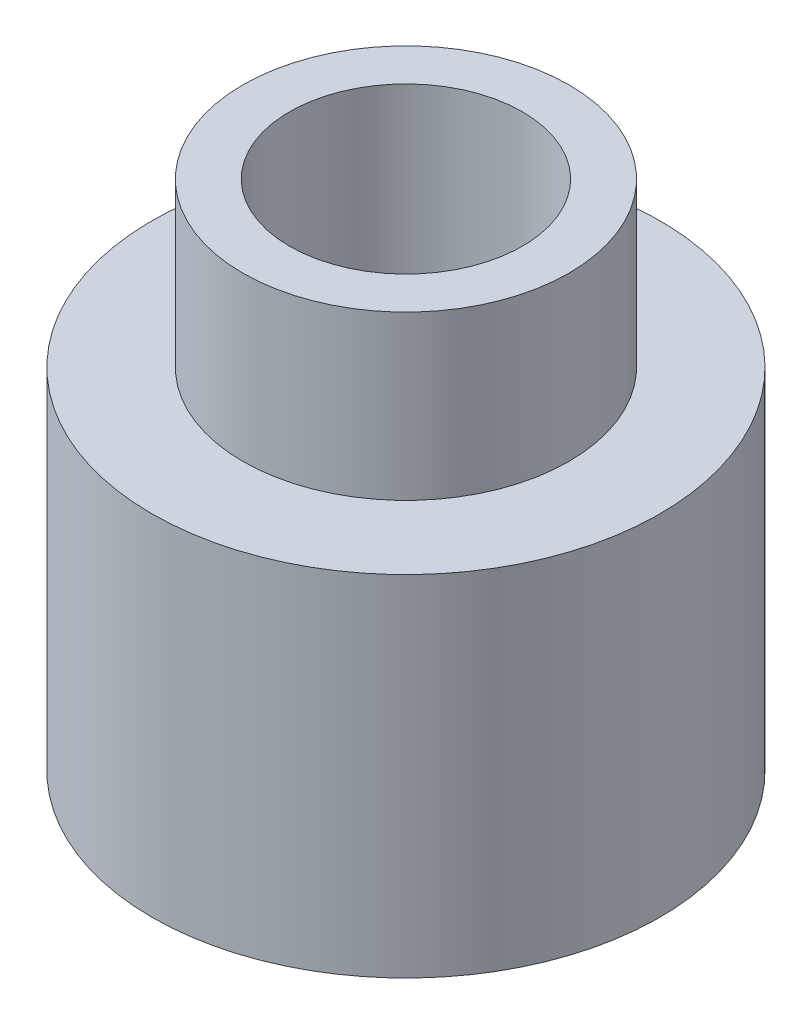
ISO-10303-21;
HEADER;
FILE_DESCRIPTION(('STEP AP214'),'2;1');
FILE_NAME('part.step','',(''),(''),'','','');
FILE_SCHEMA(('AUTOMOTIVE_DESIGN { 1 0 10303 214 1 1 1 1 }'));
ENDSEC;
DATA;
#1=APPLICATION_CONTEXT('core data for automotive mechanical design processes');
#2=APPLICATION_PROTOCOL_DEFINITION('international standard','automotive_design',2000,#1);
#3=PRODUCT_CONTEXT('',#1,'mechanical');
#4=PRODUCT('Part','Part','',(#3));
#5=PRODUCT_RELATED_PRODUCT_CATEGORY('part','',(#4));
#6=PRODUCT_DEFINITION_FORMATION('','',#4);
#7=PRODUCT_DEFINITION_CONTEXT('part definition',#1,'design');
#8=PRODUCT_DEFINITION('design','',#6,#7);
#9=PRODUCT_DEFINITION_SHAPE('','',#8);
#10=(LENGTH_UNIT() NAMED_UNIT(*) SI_UNIT(.MILLI.,.METRE.));
#11=(NAMED_UNIT(*) PLANE_ANGLE_UNIT() SI_UNIT($,.RADIAN.));
#12=(NAMED_UNIT(*) SI_UNIT($,.STERADIAN.) SOLID_ANGLE_UNIT());
#13=UNCERTAINTY_MEASURE_WITH_UNIT(LENGTH_MEASURE(1.E-05),#10,'distance_accuracy_value','');
#14=(GEOMETRIC_REPRESENTATION_CONTEXT(3) GLOBAL_UNCERTAINTY_ASSIGNED_CONTEXT((#13)) GLOBAL_UNIT_ASSIGNED_CONTEXT((#10,
#11,#12)) REPRESENTATION_CONTEXT('',''));
#15=CARTESIAN_POINT('',(0.,0.,0.));
#16=DIRECTION('',(0.,0.,1.));
#17=DIRECTION('',(1.,0.,0.));
#18=AXIS2_PLACEMENT_3D('',#15,#16,#17);
#19=CARTESIAN_POINT('',(0.,3.,0.));
#20=DIRECTION('',(0.,-1.,0.));
#21=DIRECTION('',(0.,0.,-1.));
#22=AXIS2_PLACEMENT_3D('',#19,#20,#21);
#23=CYLINDRICAL_SURFACE('',#22,2.18);
#24=CARTESIAN_POINT('',(0.,3.,0.));
#25=DIRECTION('',(0.,1.,0.));
#26=DIRECTION('',(0.,0.,1.));
#27=AXIS2_PLACEMENT_3D('',#24,#25,#26);
#28=CIRCLE('',#27,2.18);
#29=CARTESIAN_POINT('',(0.,3.,2.18));
#30=VERTEX_POINT('',#29);
#31=EDGE_CURVE('E10',#30,#30,#28,.T.);
#32=ORIENTED_EDGE('',*,*,#31,.F.);
#33=EDGE_LOOP('',(#32));
#34=FACE_BOUND('',#33,.T.);
#35=CARTESIAN_POINT('',(0.,0.,0.));
#36=DIRECTION('',(0.,1.,0.));
#37=DIRECTION('',(0.,0.,1.));
#38=AXIS2_PLACEMENT_3D('',#35,#36,#37);
#39=CIRCLE('',#38,2.18);
#40=CARTESIAN_POINT('',(0.,0.,2.18));
#41=VERTEX_POINT('',#40);
#42=EDGE_CURVE('E36',#41,#41,#39,.T.);
#43=ORIENTED_EDGE('',*,*,#42,.T.);
#44=EDGE_LOOP('',(#43));
#45=FACE_BOUND('',#44,.T.);
#46=ADVANCED_FACE('F33',(#34,#45),#23,.T.);
#47=CARTESIAN_POINT('',(0.,3.,0.));
#48=DIRECTION('',(0.,1.,0.));
#49=DIRECTION('',(0.,0.,1.));
#50=AXIS2_PLACEMENT_3D('',#47,#48,#49);
#51=PLANE('',#50);
#52=CARTESIAN_POINT('',(0.,3.,0.));
#53=DIRECTION('',(0.,1.,0.));
#54=DIRECTION('',(0.,0.,1.));
#55=AXIS2_PLACEMENT_3D('',#52,#53,#54);
#56=CIRCLE('',#55,1.4);
#57=CARTESIAN_POINT('',(0.,3.,1.4));
#58=VERTEX_POINT('',#57);
#59=EDGE_CURVE('E45',#58,#58,#56,.T.);
#60=ORIENTED_EDGE('',*,*,#59,.F.);
#61=EDGE_LOOP('',(#60));
#62=FACE_BOUND('',#61,.T.);
#63=ORIENTED_EDGE('',*,*,#31,.T.);
#64=EDGE_LOOP('',(#63));
#65=FACE_BOUND('',#64,.T.);
#66=ADVANCED_FACE('F73',(#62,#65),#51,.T.);
#67=CARTESIAN_POINT('',(0.,0.,0.));
#68=DIRECTION('',(0.,1.,0.));
#69=DIRECTION('',(0.,0.,1.));
#70=AXIS2_PLACEMENT_3D('',#67,#68,#69);
#71=PLANE('',#70);
#72=CARTESIAN_POINT('',(0.,0.,0.));
#73=DIRECTION('',(0.,1.,0.));
#74=DIRECTION('',(0.,0.,1.));
#75=AXIS2_PLACEMENT_3D('',#72,#73,#74);
#76=CIRCLE('',#75,1.);
#77=CARTESIAN_POINT('',(0.,0.,1.));
#78=VERTEX_POINT('',#77);
#79=EDGE_CURVE('E48',#78,#78,#76,.T.);
#80=ORIENTED_EDGE('',*,*,#79,.T.);
#81=EDGE_LOOP('',(#80));
#82=FACE_BOUND('',#81,.T.);
#83=ORIENTED_EDGE('',*,*,#42,.F.);
#84=EDGE_LOOP('',(#83));
#85=FACE_BOUND('',#84,.T.);
#86=ADVANCED_FACE('F69',(#82,#85),#71,.F.);
#87=CARTESIAN_POINT('',(0.,4.4,0.));
#88=DIRECTION('',(0.,-1.,0.));
#89=DIRECTION('',(0.,0.,-1.));
#90=AXIS2_PLACEMENT_3D('',#87,#88,#89);
#91=CYLINDRICAL_SURFACE('',#90,1.4);
#92=CARTESIAN_POINT('',(0.,4.4,0.));
#93=DIRECTION('',(0.,1.,0.));
#94=DIRECTION('',(0.,0.,1.));
#95=AXIS2_PLACEMENT_3D('',#92,#93,#94);
#96=CIRCLE('',#95,1.4);
#97=CARTESIAN_POINT('',(0.,4.4,1.4));
#98=VERTEX_POINT('',#97);
#99=EDGE_CURVE('E43',#98,#98,#96,.T.);
#100=ORIENTED_EDGE('',*,*,#99,.F.);
#101=EDGE_LOOP('',(#100));
#102=FACE_BOUND('',#101,.T.);
#103=ORIENTED_EDGE('',*,*,#59,.T.);
#104=EDGE_LOOP('',(#103));
#105=FACE_BOUND('',#104,.T.);
#106=ADVANCED_FACE('F63',(#102,#105),#91,.T.);
#107=CARTESIAN_POINT('',(0.,4.4,0.));
#108=DIRECTION('',(0.,1.,0.));
#109=DIRECTION('',(0.,0.,1.));
#110=AXIS2_PLACEMENT_3D('',#107,#108,#109);
#111=PLANE('',#110);
#112=CARTESIAN_POINT('',(0.,4.4,0.));
#113=DIRECTION('',(0.,1.,0.));
#114=DIRECTION('',(0.,0.,1.));
#115=AXIS2_PLACEMENT_3D('',#112,#113,#114);
#116=CIRCLE('',#115,1.);
#117=CARTESIAN_POINT('',(0.,4.4,1.));
#118=VERTEX_POINT('',#117);
#119=EDGE_CURVE('E53',#118,#118,#116,.T.);
#120=ORIENTED_EDGE('',*,*,#119,.F.);
#121=EDGE_LOOP('',(#120));
#122=FACE_BOUND('',#121,.T.);
#123=ORIENTED_EDGE('',*,*,#99,.T.);
#124=EDGE_LOOP('',(#123));
#125=FACE_BOUND('',#124,.T.);
#126=ADVANCED_FACE('F60',(#122,#125),#111,.T.);
#127=CARTESIAN_POINT('',(0.,-5.6,0.));
#128=DIRECTION('',(0.,1.,0.));
#129=DIRECTION('',(0.,0.,1.));
#130=AXIS2_PLACEMENT_3D('',#127,#128,#129);
#131=CYLINDRICAL_SURFACE('',#130,1.);
#132=ORIENTED_EDGE('',*,*,#119,.T.);
#133=EDGE_LOOP('',(#132));
#134=FACE_BOUND('',#133,.T.);
#135=ORIENTED_EDGE('',*,*,#79,.F.);
#136=EDGE_LOOP('',(#135));
#137=FACE_BOUND('',#136,.T.);
#138=ADVANCED_FACE('F57',(#134,#137),#131,.F.);
#139=CLOSED_SHELL('',(#46,#66,#86,#106,#126,#138));
#140=MANIFOLD_SOLID_BREP('B2',#139);
#141=ADVANCED_BREP_SHAPE_REPRESENTATION('',(#18,#140),#14);
#142=SHAPE_DEFINITION_REPRESENTATION(#9,#141);
ENDSEC;
END-ISO-10303-21;
